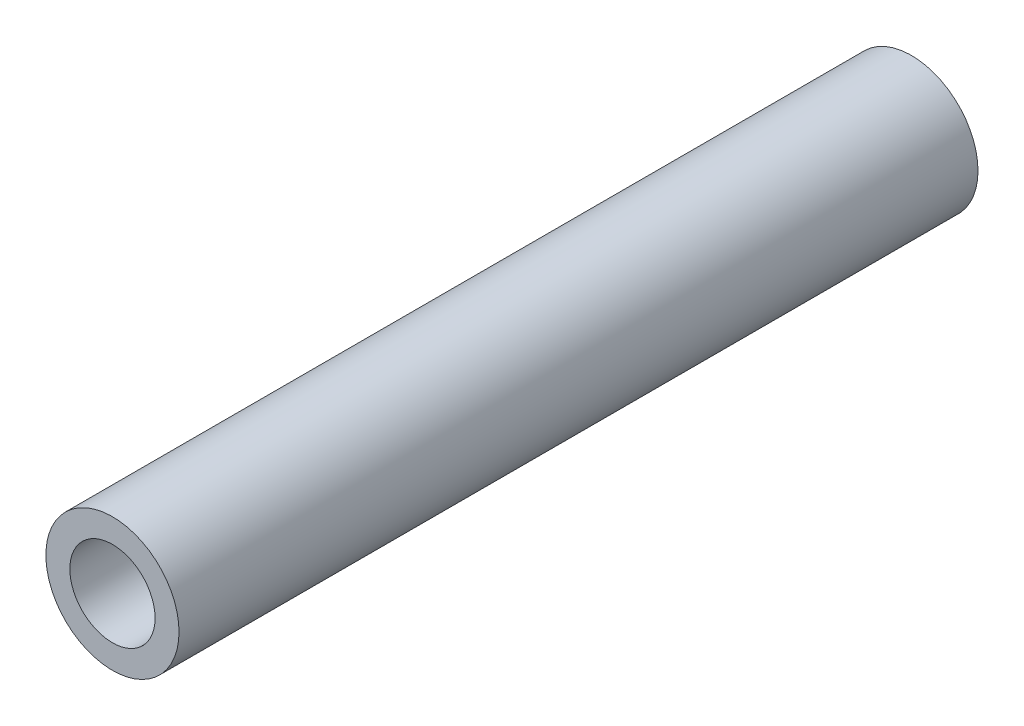
ISO-10303-21;
HEADER;
FILE_DESCRIPTION(('STEP AP214'),'2;1');
FILE_NAME('part.step','',(''),(''),'','','');
FILE_SCHEMA(('AUTOMOTIVE_DESIGN { 1 0 10303 214 1 1 1 1 }'));
ENDSEC;
DATA;
#1=APPLICATION_CONTEXT('core data for automotive mechanical design processes');
#2=APPLICATION_PROTOCOL_DEFINITION('international standard','automotive_design',2000,#1);
#3=PRODUCT_CONTEXT('',#1,'mechanical');
#4=PRODUCT('Part','Part','',(#3));
#5=PRODUCT_RELATED_PRODUCT_CATEGORY('part','',(#4));
#6=PRODUCT_DEFINITION_FORMATION('','',#4);
#7=PRODUCT_DEFINITION_CONTEXT('part definition',#1,'design');
#8=PRODUCT_DEFINITION('design','',#6,#7);
#9=PRODUCT_DEFINITION_SHAPE('','',#8);
#10=(LENGTH_UNIT() NAMED_UNIT(*) SI_UNIT(.MILLI.,.METRE.));
#11=(NAMED_UNIT(*) PLANE_ANGLE_UNIT() SI_UNIT($,.RADIAN.));
#12=(NAMED_UNIT(*) SI_UNIT($,.STERADIAN.) SOLID_ANGLE_UNIT());
#13=UNCERTAINTY_MEASURE_WITH_UNIT(LENGTH_MEASURE(1.E-05),#10,'distance_accuracy_value','');
#14=(GEOMETRIC_REPRESENTATION_CONTEXT(3) GLOBAL_UNCERTAINTY_ASSIGNED_CONTEXT((#13)) GLOBAL_UNIT_ASSIGNED_CONTEXT((#10,
#11,#12)) REPRESENTATION_CONTEXT('',''));
#15=CARTESIAN_POINT('',(0.,0.,0.));
#16=DIRECTION('',(0.,0.,1.));
#17=DIRECTION('',(1.,0.,0.));
#18=AXIS2_PLACEMENT_3D('',#15,#16,#17);
#19=CARTESIAN_POINT('',(0.,0.,30.));
#20=DIRECTION('',(0.,0.,1.));
#21=DIRECTION('',(1.,0.,0.));
#22=AXIS2_PLACEMENT_3D('',#19,#20,#21);
#23=PLANE('',#22);
#24=CARTESIAN_POINT('',(0.,0.,30.));
#25=DIRECTION('',(0.,0.,1.));
#26=DIRECTION('',(1.,0.,0.));
#27=AXIS2_PLACEMENT_3D('',#24,#25,#26);
#28=CIRCLE('',#27,2.5);
#29=CARTESIAN_POINT('',(2.5,0.,30.));
#30=VERTEX_POINT('',#29);
#31=EDGE_CURVE('E10',#30,#30,#28,.T.);
#32=ORIENTED_EDGE('',*,*,#31,.T.);
#33=EDGE_LOOP('',(#32));
#34=FACE_BOUND('',#33,.T.);
#35=CARTESIAN_POINT('',(0.,0.,30.));
#36=DIRECTION('',(0.,0.,1.));
#37=DIRECTION('',(1.,0.,0.));
#38=AXIS2_PLACEMENT_3D('',#35,#36,#37);
#39=CIRCLE('',#38,1.6);
#40=CARTESIAN_POINT('',(1.6,0.,30.));
#41=VERTEX_POINT('',#40);
#42=EDGE_CURVE('E42',#41,#41,#39,.T.);
#43=ORIENTED_EDGE('',*,*,#42,.F.);
#44=EDGE_LOOP('',(#43));
#45=FACE_BOUND('',#44,.T.);
#46=ADVANCED_FACE('F31',(#34,#45),#23,.T.);
#47=CARTESIAN_POINT('',(0.,0.,0.));
#48=DIRECTION('',(0.,0.,1.));
#49=DIRECTION('',(1.,0.,0.));
#50=AXIS2_PLACEMENT_3D('',#47,#48,#49);
#51=PLANE('',#50);
#52=CARTESIAN_POINT('',(0.,0.,0.));
#53=DIRECTION('',(0.,0.,1.));
#54=DIRECTION('',(1.,0.,0.));
#55=AXIS2_PLACEMENT_3D('',#52,#53,#54);
#56=CIRCLE('',#55,2.5);
#57=CARTESIAN_POINT('',(2.5,0.,0.));
#58=VERTEX_POINT('',#57);
#59=EDGE_CURVE('E35',#58,#58,#56,.T.);
#60=ORIENTED_EDGE('',*,*,#59,.F.);
#61=EDGE_LOOP('',(#60));
#62=FACE_BOUND('',#61,.T.);
#63=CARTESIAN_POINT('',(0.,0.,0.));
#64=DIRECTION('',(0.,0.,1.));
#65=DIRECTION('',(1.,0.,0.));
#66=AXIS2_PLACEMENT_3D('',#63,#64,#65);
#67=CIRCLE('',#66,1.6);
#68=CARTESIAN_POINT('',(1.6,0.,0.));
#69=VERTEX_POINT('',#68);
#70=EDGE_CURVE('E44',#69,#69,#67,.T.);
#71=ORIENTED_EDGE('',*,*,#70,.T.);
#72=EDGE_LOOP('',(#71));
#73=FACE_BOUND('',#72,.T.);
#74=ADVANCED_FACE('F54',(#62,#73),#51,.F.);
#75=CARTESIAN_POINT('',(0.,0.,30.));
#76=DIRECTION('',(0.,0.,-1.));
#77=DIRECTION('',(-1.,0.,0.));
#78=AXIS2_PLACEMENT_3D('',#75,#76,#77);
#79=CYLINDRICAL_SURFACE('',#78,2.5);
#80=ORIENTED_EDGE('',*,*,#31,.F.);
#81=EDGE_LOOP('',(#80));
#82=FACE_BOUND('',#81,.T.);
#83=ORIENTED_EDGE('',*,*,#59,.T.);
#84=EDGE_LOOP('',(#83));
#85=FACE_BOUND('',#84,.T.);
#86=ADVANCED_FACE('F33',(#82,#85),#79,.T.);
#87=CARTESIAN_POINT('',(0.,0.,30.));
#88=DIRECTION('',(0.,0.,-1.));
#89=DIRECTION('',(-1.,0.,0.));
#90=AXIS2_PLACEMENT_3D('',#87,#88,#89);
#91=CYLINDRICAL_SURFACE('',#90,1.6);
#92=ORIENTED_EDGE('',*,*,#42,.T.);
#93=EDGE_LOOP('',(#92));
#94=FACE_BOUND('',#93,.T.);
#95=ORIENTED_EDGE('',*,*,#70,.F.);
#96=EDGE_LOOP('',(#95));
#97=FACE_BOUND('',#96,.T.);
#98=ADVANCED_FACE('F50',(#94,#97),#91,.F.);
#99=CLOSED_SHELL('',(#46,#74,#86,#98));
#100=MANIFOLD_SOLID_BREP('B2',#99);
#101=ADVANCED_BREP_SHAPE_REPRESENTATION('',(#18,#100),#14);
#102=SHAPE_DEFINITION_REPRESENTATION(#9,#101);
ENDSEC;
END-ISO-10303-21;
